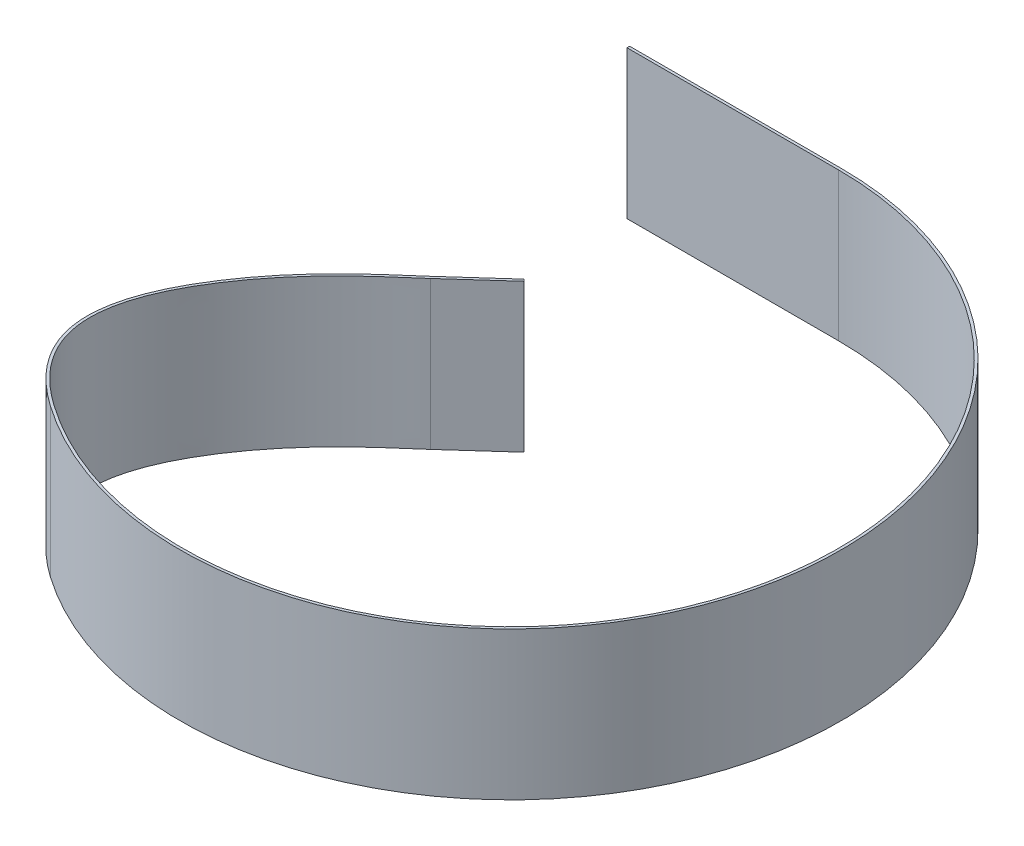
ISO-10303-21;
HEADER;
FILE_DESCRIPTION(('STEP AP214'),'2;1');
FILE_NAME('part.step','',(''),(''),'','','');
FILE_SCHEMA(('AUTOMOTIVE_DESIGN { 1 0 10303 214 1 1 1 1 }'));
ENDSEC;
DATA;
#1=APPLICATION_CONTEXT('core data for automotive mechanical design processes');
#2=APPLICATION_PROTOCOL_DEFINITION('international standard','automotive_design',2000,#1);
#3=PRODUCT_CONTEXT('',#1,'mechanical');
#4=PRODUCT('Part','Part','',(#3));
#5=PRODUCT_RELATED_PRODUCT_CATEGORY('part','',(#4));
#6=PRODUCT_DEFINITION_FORMATION('','',#4);
#7=PRODUCT_DEFINITION_CONTEXT('part definition',#1,'design');
#8=PRODUCT_DEFINITION('design','',#6,#7);
#9=PRODUCT_DEFINITION_SHAPE('','',#8);
#10=(LENGTH_UNIT() NAMED_UNIT(*) SI_UNIT(.MILLI.,.METRE.));
#11=(NAMED_UNIT(*) PLANE_ANGLE_UNIT() SI_UNIT($,.RADIAN.));
#12=(NAMED_UNIT(*) SI_UNIT($,.STERADIAN.) SOLID_ANGLE_UNIT());
#13=UNCERTAINTY_MEASURE_WITH_UNIT(LENGTH_MEASURE(1.E-05),#10,'distance_accuracy_value','');
#14=(GEOMETRIC_REPRESENTATION_CONTEXT(3) GLOBAL_UNCERTAINTY_ASSIGNED_CONTEXT((#13)) GLOBAL_UNIT_ASSIGNED_CONTEXT((#10,
#11,#12)) REPRESENTATION_CONTEXT('',''));
#15=CARTESIAN_POINT('',(0.,0.,0.));
#16=DIRECTION('',(0.,0.,1.));
#17=DIRECTION('',(1.,0.,0.));
#18=AXIS2_PLACEMENT_3D('',#15,#16,#17);
#19=CARTESIAN_POINT('',(0.,88.9,-198.4375));
#20=DIRECTION('',(0.,0.,1.));
#21=DIRECTION('',(1.,0.,0.));
#22=AXIS2_PLACEMENT_3D('',#19,#20,#21);
#23=PLANE('',#22);
#24=DIRECTION('',(1.,0.,0.));
#25=VECTOR('',#24,1.);
#26=CARTESIAN_POINT('',(0.,0.,-198.4375));
#27=LINE('',#26,#25);
#28=CARTESIAN_POINT('',(0.,0.,-198.4375));
#29=VERTEX_POINT('',#28);
#30=CARTESIAN_POINT('',(-127.,0.,-198.4375));
#31=VERTEX_POINT('',#30);
#32=EDGE_CURVE('E221',#29,#31,#27,.F.);
#33=ORIENTED_EDGE('',*,*,#32,.T.);
#34=DIRECTION('',(0.,-1.,0.));
#35=VECTOR('',#34,1.);
#36=CARTESIAN_POINT('',(-127.,88.9,-198.4375));
#37=LINE('',#36,#35);
#38=CARTESIAN_POINT('',(-127.,88.9,-198.4375));
#39=VERTEX_POINT('',#38);
#40=EDGE_CURVE('E11',#39,#31,#37,.T.);
#41=ORIENTED_EDGE('',*,*,#40,.F.);
#42=DIRECTION('',(1.,0.,0.));
#43=VECTOR('',#42,1.);
#44=CARTESIAN_POINT('',(0.,88.9,-198.4375));
#45=LINE('',#44,#43);
#46=CARTESIAN_POINT('',(0.,88.9,-198.4375));
#47=VERTEX_POINT('',#46);
#48=EDGE_CURVE('E101',#47,#39,#45,.F.);
#49=ORIENTED_EDGE('',*,*,#48,.F.);
#50=DIRECTION('',(0.,-1.,0.));
#51=VECTOR('',#50,1.);
#52=CARTESIAN_POINT('',(0.,88.9,-198.4375));
#53=LINE('',#52,#51);
#54=EDGE_CURVE('E142',#47,#29,#53,.T.);
#55=ORIENTED_EDGE('',*,*,#54,.T.);
#56=EDGE_LOOP('',(#33,#41,#49,#55));
#57=FACE_BOUND('',#56,.T.);
#58=ADVANCED_FACE('F39',(#57),#23,.F.);
#59=CARTESIAN_POINT('',(-127.,88.9,-196.85));
#60=DIRECTION('',(-1.,0.,0.));
#61=DIRECTION('',(0.,0.,1.));
#62=AXIS2_PLACEMENT_3D('',#59,#60,#61);
#63=PLANE('',#62);
#64=DIRECTION('',(0.,0.,-1.));
#65=VECTOR('',#64,1.);
#66=CARTESIAN_POINT('',(-127.,0.,-196.85));
#67=LINE('',#66,#65);
#68=CARTESIAN_POINT('',(-127.,0.,-196.85));
#69=VERTEX_POINT('',#68);
#70=EDGE_CURVE('E216',#69,#31,#67,.T.);
#71=ORIENTED_EDGE('',*,*,#70,.F.);
#72=DIRECTION('',(0.,-1.,0.));
#73=VECTOR('',#72,1.);
#74=CARTESIAN_POINT('',(-127.,88.9,-196.85));
#75=LINE('',#74,#73);
#76=CARTESIAN_POINT('',(-127.,88.9,-196.85));
#77=VERTEX_POINT('',#76);
#78=EDGE_CURVE('E47',#77,#69,#75,.T.);
#79=ORIENTED_EDGE('',*,*,#78,.F.);
#80=DIRECTION('',(0.,0.,-1.));
#81=VECTOR('',#80,1.);
#82=CARTESIAN_POINT('',(-127.,88.9,-196.85));
#83=LINE('',#82,#81);
#84=EDGE_CURVE('E250',#77,#39,#83,.T.);
#85=ORIENTED_EDGE('',*,*,#84,.T.);
#86=ORIENTED_EDGE('',*,*,#40,.T.);
#87=EDGE_LOOP('',(#71,#79,#85,#86));
#88=FACE_BOUND('',#87,.T.);
#89=ADVANCED_FACE('F217',(#88),#63,.T.);
#90=CARTESIAN_POINT('',(0.,88.9,-196.85));
#91=DIRECTION('',(0.,0.,1.));
#92=DIRECTION('',(1.,0.,0.));
#93=AXIS2_PLACEMENT_3D('',#90,#91,#92);
#94=PLANE('',#93);
#95=DIRECTION('',(-1.,0.,0.));
#96=VECTOR('',#95,1.);
#97=CARTESIAN_POINT('',(0.,0.,-196.85));
#98=LINE('',#97,#96);
#99=CARTESIAN_POINT('',(0.,0.,-196.85));
#100=VERTEX_POINT('',#99);
#101=EDGE_CURVE('E209',#100,#69,#98,.T.);
#102=ORIENTED_EDGE('',*,*,#101,.F.);
#103=DIRECTION('',(0.,-1.,0.));
#104=VECTOR('',#103,1.);
#105=CARTESIAN_POINT('',(0.,88.9,-196.85));
#106=LINE('',#105,#104);
#107=CARTESIAN_POINT('',(0.,88.9,-196.85));
#108=VERTEX_POINT('',#107);
#109=EDGE_CURVE('E202',#108,#100,#106,.T.);
#110=ORIENTED_EDGE('',*,*,#109,.F.);
#111=DIRECTION('',(-1.,0.,0.));
#112=VECTOR('',#111,1.);
#113=CARTESIAN_POINT('',(0.,88.9,-196.85));
#114=LINE('',#113,#112);
#115=EDGE_CURVE('E212',#108,#77,#114,.T.);
#116=ORIENTED_EDGE('',*,*,#115,.T.);
#117=ORIENTED_EDGE('',*,*,#78,.T.);
#118=EDGE_LOOP('',(#102,#110,#116,#117));
#119=FACE_BOUND('',#118,.T.);
#120=ADVANCED_FACE('F207',(#119),#94,.T.);
#121=CARTESIAN_POINT('',(0.,88.9,0.));
#122=DIRECTION('',(0.,-1.,0.));
#123=DIRECTION('',(0.,0.,-1.));
#124=AXIS2_PLACEMENT_3D('',#121,#122,#123);
#125=CYLINDRICAL_SURFACE('',#124,196.85);
#126=CARTESIAN_POINT('',(0.,0.,0.));
#127=DIRECTION('',(0.,1.,0.));
#128=DIRECTION('',(0.,0.,1.));
#129=AXIS2_PLACEMENT_3D('',#126,#127,#128);
#130=CIRCLE('',#129,196.85);
#131=CARTESIAN_POINT('',(-112.908521495704,0.,161.250079918288));
#132=VERTEX_POINT('',#131);
#133=EDGE_CURVE('E226',#132,#100,#130,.T.);
#134=ORIENTED_EDGE('',*,*,#133,.F.);
#135=DIRECTION('',(0.,-1.,0.));
#136=VECTOR('',#135,1.);
#137=CARTESIAN_POINT('',(-112.908521495704,88.9,161.250079918288));
#138=LINE('',#137,#136);
#139=CARTESIAN_POINT('',(-112.908521495704,88.9,161.250079918288));
#140=VERTEX_POINT('',#139);
#141=EDGE_CURVE('E200',#140,#132,#138,.T.);
#142=ORIENTED_EDGE('',*,*,#141,.F.);
#143=CARTESIAN_POINT('',(0.,88.9,0.));
#144=DIRECTION('',(0.,1.,0.));
#145=DIRECTION('',(0.,0.,1.));
#146=AXIS2_PLACEMENT_3D('',#143,#144,#145);
#147=CIRCLE('',#146,196.85);
#148=EDGE_CURVE('E183',#140,#108,#147,.T.);
#149=ORIENTED_EDGE('',*,*,#148,.T.);
#150=ORIENTED_EDGE('',*,*,#109,.T.);
#151=EDGE_LOOP('',(#134,#142,#149,#150));
#152=FACE_BOUND('',#151,.T.);
#153=ADVANCED_FACE('F172',(#152),#125,.F.);
#154=CARTESIAN_POINT('',(-66.0024496483373,88.9,-17.8844728997143));
#155=CARTESIAN_POINT('',(-66.4535877933624,88.9,-17.4782662893966));
#156=CARTESIAN_POINT('',(-67.3455990510589,88.9,-16.6824248164121));
#157=CARTESIAN_POINT('',(-69.251908014198,88.9,-15.0029626165492));
#158=CARTESIAN_POINT('',(-71.788924143044,88.9,-12.794824311987));
#159=CARTESIAN_POINT('',(-75.0919496078127,88.9,-9.92560648370046));
#160=CARTESIAN_POINT('',(-79.8061970469973,88.9,-5.79511599937475));
#161=CARTESIAN_POINT('',(-86.2257511246115,88.9,-0.0297921201301938));
#162=CARTESIAN_POINT('',(-94.5507374651459,88.9,7.90614390022119));
#163=CARTESIAN_POINT('',(-103.257345936926,88.9,16.8945797608324));
#164=CARTESIAN_POINT('',(-112.101117892182,88.9,26.9654788928242));
#165=CARTESIAN_POINT('',(-120.828764325615,88.9,38.1334318247923));
#166=CARTESIAN_POINT('',(-129.216728981837,88.9,50.4549237361451));
#167=CARTESIAN_POINT('',(-136.940899544424,88.9,63.8288896466943));
#168=CARTESIAN_POINT('',(-143.161892373003,88.9,77.7582718705679));
#169=CARTESIAN_POINT('',(-147.210909845573,88.9,91.8686804501743));
#170=CARTESIAN_POINT('',(-148.31437068579,88.9,103.458143904325));
#171=CARTESIAN_POINT('',(-147.621588874118,88.9,112.577839852921));
#172=CARTESIAN_POINT('',(-146.250002481882,88.9,119.374309222635));
#173=CARTESIAN_POINT('',(-143.936843504465,88.9,126.17470344159));
#174=CARTESIAN_POINT('',(-140.558076203167,88.9,133.031995567463));
#175=CARTESIAN_POINT('',(-135.959944926544,88.9,139.980748795807));
#176=CARTESIAN_POINT('',(-130.973108438022,88.9,145.8499680956));
#177=CARTESIAN_POINT('',(-126.208771051371,88.9,150.578610224839));
#178=CARTESIAN_POINT('',(-122.231373292768,88.9,154.134237209882));
#179=CARTESIAN_POINT('',(-118.558206922946,88.9,157.104221465783));
#180=CARTESIAN_POINT('',(-115.41175898818,88.9,159.469720498676));
#181=CARTESIAN_POINT('',(-113.741298162684,88.9,160.666963418423));
#182=CARTESIAN_POINT('',(-112.908521495704,88.9,161.250079918288));
#183=B_SPLINE_CURVE_WITH_KNOTS('',3,(#154,#155,#156,#157,#158,#159,#160,#161,#162,#163,#164,
#165,#166,#167,#168,#169,#170,#171,#172,#173,#174,#175,#176,#177,#178,#179,#180,#181,#182),
.UNSPECIFIED.,.F.,.F.,(4,1,1,1,1,1,1,1,1,1,1,1,1,1,1,1,1,1,1,1,1,1,1,1,1,1,4),(0.,
0.0138611581351266,0.0277223162702532,0.0554446325405066,0.0831669488107599,0.110889265081013,
0.16633389762152,0.221778530162027,0.277223162702533,0.33266779524304,0.388112427783546,
0.443557060324053,0.49900169286456,0.554446325405066,0.609890957945573,0.665335590486079,
0.693057906756333,0.720780223026586,0.748502539296839,0.776224855567093,0.803947171837346,
0.831669488107599,0.845530646242726,0.859391804377853,0.873252962512979,0.880183541580543,
0.887114120648106),.UNSPECIFIED.);
#184=DIRECTION('',(0.,-1.,0.));
#185=VECTOR('',#184,1.);
#186=SURFACE_OF_LINEAR_EXTRUSION('',#183,#185);
#187=CARTESIAN_POINT('',(-66.0024496483373,0.,-17.8844728997143));
#188=CARTESIAN_POINT('',(-66.4535877933624,0.,-17.4782662893966));
#189=CARTESIAN_POINT('',(-67.3455990510589,0.,-16.6824248164121));
#190=CARTESIAN_POINT('',(-69.251908014198,0.,-15.0029626165492));
#191=CARTESIAN_POINT('',(-71.788924143044,0.,-12.794824311987));
#192=CARTESIAN_POINT('',(-75.0919496078127,0.,-9.92560648370046));
#193=CARTESIAN_POINT('',(-79.8061970469973,0.,-5.79511599937475));
#194=CARTESIAN_POINT('',(-86.2257511246115,0.,-0.0297921201301938));
#195=CARTESIAN_POINT('',(-94.5507374651459,0.,7.90614390022119));
#196=CARTESIAN_POINT('',(-103.257345936926,0.,16.8945797608324));
#197=CARTESIAN_POINT('',(-112.101117892182,0.,26.9654788928242));
#198=CARTESIAN_POINT('',(-120.828764325615,0.,38.1334318247923));
#199=CARTESIAN_POINT('',(-129.216728981837,0.,50.4549237361451));
#200=CARTESIAN_POINT('',(-136.940899544424,0.,63.8288896466943));
#201=CARTESIAN_POINT('',(-143.161892373003,0.,77.7582718705679));
#202=CARTESIAN_POINT('',(-147.210909845573,0.,91.8686804501743));
#203=CARTESIAN_POINT('',(-148.31437068579,0.,103.458143904325));
#204=CARTESIAN_POINT('',(-147.621588874118,0.,112.577839852921));
#205=CARTESIAN_POINT('',(-146.250002481882,0.,119.374309222635));
#206=CARTESIAN_POINT('',(-143.936843504465,0.,126.17470344159));
#207=CARTESIAN_POINT('',(-140.558076203167,0.,133.031995567463));
#208=CARTESIAN_POINT('',(-135.959944926544,0.,139.980748795807));
#209=CARTESIAN_POINT('',(-130.973108438022,0.,145.8499680956));
#210=CARTESIAN_POINT('',(-126.208771051371,0.,150.578610224839));
#211=CARTESIAN_POINT('',(-122.231373292768,0.,154.134237209882));
#212=CARTESIAN_POINT('',(-118.558206922946,0.,157.104221465783));
#213=CARTESIAN_POINT('',(-115.41175898818,0.,159.469720498676));
#214=CARTESIAN_POINT('',(-113.741298162684,0.,160.666963418423));
#215=CARTESIAN_POINT('',(-112.908521495704,0.,161.250079918288));
#216=B_SPLINE_CURVE_WITH_KNOTS('',3,(#187,#188,#189,#190,#191,#192,#193,#194,#195,#196,#197,
#198,#199,#200,#201,#202,#203,#204,#205,#206,#207,#208,#209,#210,#211,#212,#213,#214,#215),
.UNSPECIFIED.,.F.,.F.,(4,1,1,1,1,1,1,1,1,1,1,1,1,1,1,1,1,1,1,1,1,1,1,1,1,1,4),(0.,
0.0138611581351266,0.0277223162702532,0.0554446325405066,0.0831669488107599,0.110889265081013,
0.16633389762152,0.221778530162027,0.277223162702533,0.33266779524304,0.388112427783546,
0.443557060324053,0.49900169286456,0.554446325405066,0.609890957945573,0.665335590486079,
0.693057906756333,0.720780223026586,0.748502539296839,0.776224855567093,0.803947171837346,
0.831669488107599,0.845530646242726,0.859391804377853,0.873252962512979,0.880183541580543,
0.887114120648106),.UNSPECIFIED.);
#217=CARTESIAN_POINT('',(-66.0024496483373,0.,-17.8844728997143));
#218=VERTEX_POINT('',#217);
#219=EDGE_CURVE('E228',#218,#132,#216,.T.);
#220=ORIENTED_EDGE('',*,*,#219,.F.);
#221=DIRECTION('',(0.,-1.,0.));
#222=VECTOR('',#221,1.);
#223=CARTESIAN_POINT('',(-66.0024496483373,88.9,-17.8844728997143));
#224=LINE('',#223,#222);
#225=CARTESIAN_POINT('',(-66.0024496483373,88.9,-17.8844728997143));
#226=VERTEX_POINT('',#225);
#227=EDGE_CURVE('E195',#226,#218,#224,.T.);
#228=ORIENTED_EDGE('',*,*,#227,.F.);
#229=EDGE_CURVE('E175',#226,#140,#183,.T.);
#230=ORIENTED_EDGE('',*,*,#229,.T.);
#231=ORIENTED_EDGE('',*,*,#141,.T.);
#232=EDGE_LOOP('',(#220,#228,#230,#231));
#233=FACE_BOUND('',#232,.T.);
#234=ADVANCED_FACE('F167',(#233),#186,.T.);
#235=CARTESIAN_POINT('',(-36.498442787726,88.9,-44.45));
#236=DIRECTION('',(0.66913060635886,0.,0.743144825477393));
#237=DIRECTION('',(0.743144825477393,0.,-0.66913060635886));
#238=AXIS2_PLACEMENT_3D('',#235,#236,#237);
#239=PLANE('',#238);
#240=DIRECTION('',(-0.743144825477393,0.,0.66913060635886));
#241=VECTOR('',#240,1.);
#242=CARTESIAN_POINT('',(-36.498442787726,0.,-44.45));
#243=LINE('',#242,#241);
#244=CARTESIAN_POINT('',(-36.498442787726,0.,-44.45));
#245=VERTEX_POINT('',#244);
#246=EDGE_CURVE('E234',#245,#218,#243,.T.);
#247=ORIENTED_EDGE('',*,*,#246,.F.);
#248=DIRECTION('',(0.,-1.,0.));
#249=VECTOR('',#248,1.);
#250=CARTESIAN_POINT('',(-36.498442787726,88.9,-44.45));
#251=LINE('',#250,#249);
#252=CARTESIAN_POINT('',(-36.498442787726,88.9,-44.45));
#253=VERTEX_POINT('',#252);
#254=EDGE_CURVE('E190',#253,#245,#251,.T.);
#255=ORIENTED_EDGE('',*,*,#254,.F.);
#256=DIRECTION('',(-0.743144825477393,0.,0.66913060635886));
#257=VECTOR('',#256,1.);
#258=CARTESIAN_POINT('',(-36.498442787726,88.9,-44.45));
#259=LINE('',#258,#257);
#260=EDGE_CURVE('E182',#253,#226,#259,.T.);
#261=ORIENTED_EDGE('',*,*,#260,.T.);
#262=ORIENTED_EDGE('',*,*,#227,.T.);
#263=EDGE_LOOP('',(#247,#255,#261,#262));
#264=FACE_BOUND('',#263,.T.);
#265=ADVANCED_FACE('F163',(#264),#239,.T.);
#266=CARTESIAN_POINT('',(-37.5606876253207,88.9,-45.6297424104454));
#267=DIRECTION('',(0.743144825477393,0.,-0.66913060635886));
#268=DIRECTION('',(-0.66913060635886,0.,-0.743144825477393));
#269=AXIS2_PLACEMENT_3D('',#266,#267,#268);
#270=PLANE('',#269);
#271=DIRECTION('',(0.66913060635886,0.,0.743144825477393));
#272=VECTOR('',#271,1.);
#273=CARTESIAN_POINT('',(-37.5606876253207,0.,-45.6297424104454));
#274=LINE('',#273,#272);
#275=CARTESIAN_POINT('',(-37.5606876253207,0.,-45.6297424104454));
#276=VERTEX_POINT('',#275);
#277=EDGE_CURVE('E193',#276,#245,#274,.T.);
#278=ORIENTED_EDGE('',*,*,#277,.F.);
#279=DIRECTION('',(0.,-1.,0.));
#280=VECTOR('',#279,1.);
#281=CARTESIAN_POINT('',(-37.5606876253207,88.9,-45.6297424104454));
#282=LINE('',#281,#280);
#283=CARTESIAN_POINT('',(-37.5606876253207,88.9,-45.6297424104454));
#284=VERTEX_POINT('',#283);
#285=EDGE_CURVE('E137',#284,#276,#282,.T.);
#286=ORIENTED_EDGE('',*,*,#285,.F.);
#287=DIRECTION('',(0.66913060635886,0.,0.743144825477393));
#288=VECTOR('',#287,1.);
#289=CARTESIAN_POINT('',(-37.5606876253207,88.9,-45.6297424104454));
#290=LINE('',#289,#288);
#291=EDGE_CURVE('E130',#284,#253,#290,.T.);
#292=ORIENTED_EDGE('',*,*,#291,.T.);
#293=ORIENTED_EDGE('',*,*,#254,.T.);
#294=EDGE_LOOP('',(#278,#286,#292,#293));
#295=FACE_BOUND('',#294,.T.);
#296=ADVANCED_FACE('F160',(#295),#270,.T.);
#297=CARTESIAN_POINT('',(-37.5606876253207,88.9,-45.6297424104454));
#298=DIRECTION('',(0.66913060635886,0.,0.743144825477393));
#299=DIRECTION('',(0.743144825477393,0.,-0.66913060635886));
#300=AXIS2_PLACEMENT_3D('',#297,#298,#299);
#301=PLANE('',#300);
#302=DIRECTION('',(-0.743144825477393,0.,0.66913060635886));
#303=VECTOR('',#302,1.);
#304=CARTESIAN_POINT('',(-37.5606876253207,0.,-45.6297424104454));
#305=LINE('',#304,#303);
#306=CARTESIAN_POINT('',(-67.064694485932,0.,-19.0642153101597));
#307=VERTEX_POINT('',#306);
#308=EDGE_CURVE('E136',#276,#307,#305,.T.);
#309=ORIENTED_EDGE('',*,*,#308,.T.);
#310=DIRECTION('',(0.,-1.,0.));
#311=VECTOR('',#310,1.);
#312=CARTESIAN_POINT('',(-67.064694485932,88.9,-19.0642153101597));
#313=LINE('',#312,#311);
#314=CARTESIAN_POINT('',(-67.064694485932,88.9,-19.0642153101597));
#315=VERTEX_POINT('',#314);
#316=EDGE_CURVE('E133',#315,#307,#313,.T.);
#317=ORIENTED_EDGE('',*,*,#316,.F.);
#318=DIRECTION('',(-0.743144825477393,0.,0.66913060635886));
#319=VECTOR('',#318,1.);
#320=CARTESIAN_POINT('',(-37.5606876253207,88.9,-45.6297424104454));
#321=LINE('',#320,#319);
#322=EDGE_CURVE('E123',#284,#315,#321,.T.);
#323=ORIENTED_EDGE('',*,*,#322,.F.);
#324=ORIENTED_EDGE('',*,*,#285,.T.);
#325=EDGE_LOOP('',(#309,#317,#323,#324));
#326=FACE_BOUND('',#325,.T.);
#327=ADVANCED_FACE('F134',(#326),#301,.F.);
#328=CARTESIAN_POINT('',(-67.0646944859319,88.9,-19.0642153101597));
#329=CARTESIAN_POINT('',(-67.5123044387745,88.9,-18.6611854983523));
#330=CARTESIAN_POINT('',(-67.9551023909119,88.9,-18.2661229476099));
#331=CARTESIAN_POINT('',(-68.872729801477,88.9,-17.4527292275026));
#332=CARTESIAN_POINT('',(-69.3473142608288,88.9,-17.0346170891996));
#333=CARTESIAN_POINT('',(-70.802994816759,88.9,-15.757537091635));
#334=CARTESIAN_POINT('',(-71.8161310917068,88.9,-14.8757292431817));
#335=CARTESIAN_POINT('',(-74.9886924382968,88.9,-12.1172468688137));
#336=CARTESIAN_POINT('',(-77.2800721107781,88.9,-10.128491367995));
#337=CARTESIAN_POINT('',(-84.5821858480731,88.9,-3.67415385299682));
#338=CARTESIAN_POINT('',(-90.0262606126615,88.9,1.28435614913448));
#339=CARTESIAN_POINT('',(-101.440385317245,88.9,12.6266228789879));
#340=CARTESIAN_POINT('',(-107.409172858783,88.9,19.0100871552374));
#341=CARTESIAN_POINT('',(-116.252796510844,88.9,29.6995153106998));
#342=CARTESIAN_POINT('',(-119.182120842643,88.9,33.4478298378293));
#343=CARTESIAN_POINT('',(-124.928234054716,88.9,41.3337889573397));
#344=CARTESIAN_POINT('',(-127.744912223715,88.9,45.47125665122));
#345=CARTESIAN_POINT('',(-133.157203889158,88.9,54.1027204715375));
#346=CARTESIAN_POINT('',(-135.75496211648,88.9,58.5998971226881));
#347=CARTESIAN_POINT('',(-140.453322416897,88.9,67.7988547357973));
#348=CARTESIAN_POINT('',(-142.553268995806,88.9,72.4992223873085));
#349=CARTESIAN_POINT('',(-146.027842566337,88.9,81.985709079352));
#350=CARTESIAN_POINT('',(-147.401894666237,88.9,86.7701065059958));
#351=CARTESIAN_POINT('',(-149.229813654371,88.9,96.3015748128057));
#352=CARTESIAN_POINT('',(-149.683131709763,88.9,101.0478857231));
#353=CARTESIAN_POINT('',(-149.511096887446,88.9,110.460954732744));
#354=CARTESIAN_POINT('',(-148.889230889081,88.9,115.126263437114));
#355=CARTESIAN_POINT('',(-146.993343946223,88.9,122.122165068173));
#356=CARTESIAN_POINT('',(-146.199696578408,88.9,124.455098814042));
#357=CARTESIAN_POINT('',(-144.249463658549,88.9,129.134651607689));
#358=CARTESIAN_POINT('',(-143.092429230443,88.9,131.482378871933));
#359=CARTESIAN_POINT('',(-140.366383882415,88.9,136.20049147483));
#360=CARTESIAN_POINT('',(-138.796962052794,88.9,138.571659295687));
#361=CARTESIAN_POINT('',(-135.193197127037,88.9,143.336507209459));
#362=CARTESIAN_POINT('',(-133.158587596331,88.9,145.730602241969));
#363=CARTESIAN_POINT('',(-128.572257647049,88.9,150.532205717169));
#364=CARTESIAN_POINT('',(-126.022120384449,88.9,152.938660304707));
#365=CARTESIAN_POINT('',(-121.769630358283,88.9,156.549316196165));
#366=CARTESIAN_POINT('',(-120.280715667145,88.9,157.753149063812));
#367=CARTESIAN_POINT('',(-117.943674717478,88.9,159.552363046343));
#368=CARTESIAN_POINT('',(-117.147213580727,88.9,160.151137690389));
#369=CARTESIAN_POINT('',(-115.505927687951,88.9,161.355400206591));
#370=CARTESIAN_POINT('',(-114.661481322571,88.9,161.960623892995));
#371=CARTESIAN_POINT('',(-113.819074088411,88.9,162.550483788597));
#372=B_SPLINE_CURVE_WITH_KNOTS('',3,(#328,#329,#330,#331,#332,#333,#334,#335,#336,#337,#338,
#339,#340,#341,#342,#343,#344,#345,#346,#347,#348,#349,#350,#351,#352,#353,#354,#355,#356,#357,
#358,#359,#360,#361,#362,#363,#364,#365,#366,#367,#368,#369,#370,#371),.UNSPECIFIED.,.F.,.F.,(4,
2,2,2,2,2,2,2,2,2,2,2,2,2,2,2,2,2,2,2,2,4),(0.,0.0156250000000001,0.0312500000000002,
0.0625000000000003,0.125,0.25,0.375,0.4375,0.5,0.5625,0.625,0.6875,0.75,0.8125,0.84375,0.875,
0.90625,0.9375,0.96875,0.984375,0.9921875,1.),.UNSPECIFIED.);
#373=DIRECTION('',(0.,-1.,0.));
#374=VECTOR('',#373,1.);
#375=SURFACE_OF_LINEAR_EXTRUSION('',#372,#374);
#376=CARTESIAN_POINT('',(-67.0646944859319,0.,-19.0642153101597));
#377=CARTESIAN_POINT('',(-67.5123044387745,0.,-18.6611854983523));
#378=CARTESIAN_POINT('',(-67.9551023909119,0.,-18.2661229476099));
#379=CARTESIAN_POINT('',(-68.872729801477,0.,-17.4527292275026));
#380=CARTESIAN_POINT('',(-69.3473142608288,0.,-17.0346170891996));
#381=CARTESIAN_POINT('',(-70.802994816759,0.,-15.757537091635));
#382=CARTESIAN_POINT('',(-71.8161310917068,0.,-14.8757292431817));
#383=CARTESIAN_POINT('',(-74.9886924382968,0.,-12.1172468688137));
#384=CARTESIAN_POINT('',(-77.2800721107781,0.,-10.128491367995));
#385=CARTESIAN_POINT('',(-84.5821858480731,0.,-3.67415385299682));
#386=CARTESIAN_POINT('',(-90.0262606126615,0.,1.28435614913448));
#387=CARTESIAN_POINT('',(-101.440385317245,0.,12.6266228789879));
#388=CARTESIAN_POINT('',(-107.409172858783,0.,19.0100871552374));
#389=CARTESIAN_POINT('',(-116.252796510844,0.,29.6995153106998));
#390=CARTESIAN_POINT('',(-119.182120842643,0.,33.4478298378293));
#391=CARTESIAN_POINT('',(-124.928234054716,0.,41.3337889573397));
#392=CARTESIAN_POINT('',(-127.744912223715,0.,45.47125665122));
#393=CARTESIAN_POINT('',(-133.157203889158,0.,54.1027204715375));
#394=CARTESIAN_POINT('',(-135.75496211648,0.,58.5998971226881));
#395=CARTESIAN_POINT('',(-140.453322416897,0.,67.7988547357973));
#396=CARTESIAN_POINT('',(-142.553268995806,0.,72.4992223873085));
#397=CARTESIAN_POINT('',(-146.027842566337,0.,81.985709079352));
#398=CARTESIAN_POINT('',(-147.401894666237,0.,86.7701065059958));
#399=CARTESIAN_POINT('',(-149.229813654371,0.,96.3015748128057));
#400=CARTESIAN_POINT('',(-149.683131709763,0.,101.0478857231));
#401=CARTESIAN_POINT('',(-149.511096887446,0.,110.460954732744));
#402=CARTESIAN_POINT('',(-148.889230889081,0.,115.126263437114));
#403=CARTESIAN_POINT('',(-146.993343946223,0.,122.122165068173));
#404=CARTESIAN_POINT('',(-146.199696578408,0.,124.455098814042));
#405=CARTESIAN_POINT('',(-144.249463658549,0.,129.134651607689));
#406=CARTESIAN_POINT('',(-143.092429230443,0.,131.482378871933));
#407=CARTESIAN_POINT('',(-140.366383882415,0.,136.20049147483));
#408=CARTESIAN_POINT('',(-138.796962052794,0.,138.571659295687));
#409=CARTESIAN_POINT('',(-135.193197127037,0.,143.336507209459));
#410=CARTESIAN_POINT('',(-133.158587596331,0.,145.730602241969));
#411=CARTESIAN_POINT('',(-128.572257647049,0.,150.532205717169));
#412=CARTESIAN_POINT('',(-126.022120384449,0.,152.938660304707));
#413=CARTESIAN_POINT('',(-121.769630358283,0.,156.549316196165));
#414=CARTESIAN_POINT('',(-120.280715667145,0.,157.753149063812));
#415=CARTESIAN_POINT('',(-117.943674717478,0.,159.552363046343));
#416=CARTESIAN_POINT('',(-117.147213580727,0.,160.151137690389));
#417=CARTESIAN_POINT('',(-115.505927687951,0.,161.355400206591));
#418=CARTESIAN_POINT('',(-114.661481322571,0.,161.960623892995));
#419=CARTESIAN_POINT('',(-113.819074088411,0.,162.550483788597));
#420=B_SPLINE_CURVE_WITH_KNOTS('',3,(#376,#377,#378,#379,#380,#381,#382,#383,#384,#385,#386,
#387,#388,#389,#390,#391,#392,#393,#394,#395,#396,#397,#398,#399,#400,#401,#402,#403,#404,#405,
#406,#407,#408,#409,#410,#411,#412,#413,#414,#415,#416,#417,#418,#419),.UNSPECIFIED.,.F.,.F.,(4,
2,2,2,2,2,2,2,2,2,2,2,2,2,2,2,2,2,2,2,2,4),(0.,0.0156250000000001,0.0312500000000002,
0.0625000000000003,0.125,0.25,0.375,0.4375,0.5,0.5625,0.625,0.6875,0.75,0.8125,0.84375,0.875,
0.90625,0.9375,0.96875,0.984375,0.9921875,1.),.UNSPECIFIED.);
#421=CARTESIAN_POINT('',(-113.819074088411,0.,162.550483788597));
#422=VERTEX_POINT('',#421);
#423=EDGE_CURVE('E89',#307,#422,#420,.T.);
#424=ORIENTED_EDGE('',*,*,#423,.T.);
#425=DIRECTION('',(0.,-1.,0.));
#426=VECTOR('',#425,1.);
#427=CARTESIAN_POINT('',(-113.819074088411,88.9,162.550483788597));
#428=LINE('',#427,#426);
#429=CARTESIAN_POINT('',(-113.819074088411,88.9,162.550483788597));
#430=VERTEX_POINT('',#429);
#431=EDGE_CURVE('E138',#430,#422,#428,.T.);
#432=ORIENTED_EDGE('',*,*,#431,.F.);
#433=EDGE_CURVE('E127',#315,#430,#372,.T.);
#434=ORIENTED_EDGE('',*,*,#433,.F.);
#435=ORIENTED_EDGE('',*,*,#316,.T.);
#436=EDGE_LOOP('',(#424,#432,#434,#435));
#437=FACE_BOUND('',#436,.T.);
#438=ADVANCED_FACE('F140',(#437),#375,.F.);
#439=CARTESIAN_POINT('',(0.,88.9,0.));
#440=DIRECTION('',(0.,-1.,0.));
#441=DIRECTION('',(0.,0.,-1.));
#442=AXIS2_PLACEMENT_3D('',#439,#440,#441);
#443=CYLINDRICAL_SURFACE('',#442,198.4375);
#444=CARTESIAN_POINT('',(0.,0.,0.));
#445=DIRECTION('',(0.,1.,0.));
#446=DIRECTION('',(1.,0.,0.));
#447=AXIS2_PLACEMENT_3D('',#444,#445,#446);
#448=CIRCLE('',#447,198.4375);
#449=EDGE_CURVE('E95',#422,#29,#448,.T.);
#450=ORIENTED_EDGE('',*,*,#449,.T.);
#451=ORIENTED_EDGE('',*,*,#54,.F.);
#452=CARTESIAN_POINT('',(0.,88.9,0.));
#453=DIRECTION('',(0.,1.,0.));
#454=DIRECTION('',(1.,0.,0.));
#455=AXIS2_PLACEMENT_3D('',#452,#453,#454);
#456=CIRCLE('',#455,198.4375);
#457=EDGE_CURVE('E55',#430,#47,#456,.T.);
#458=ORIENTED_EDGE('',*,*,#457,.F.);
#459=ORIENTED_EDGE('',*,*,#431,.T.);
#460=EDGE_LOOP('',(#450,#451,#458,#459));
#461=FACE_BOUND('',#460,.T.);
#462=ADVANCED_FACE('F156',(#461),#443,.T.);
#463=CARTESIAN_POINT('',(0.,88.9,0.));
#464=DIRECTION('',(0.,1.,0.));
#465=DIRECTION('',(1.,0.,0.));
#466=AXIS2_PLACEMENT_3D('',#463,#464,#465);
#467=PLANE('',#466);
#468=ORIENTED_EDGE('',*,*,#48,.T.);
#469=ORIENTED_EDGE('',*,*,#84,.F.);
#470=ORIENTED_EDGE('',*,*,#115,.F.);
#471=ORIENTED_EDGE('',*,*,#148,.F.);
#472=ORIENTED_EDGE('',*,*,#229,.F.);
#473=ORIENTED_EDGE('',*,*,#260,.F.);
#474=ORIENTED_EDGE('',*,*,#291,.F.);
#475=ORIENTED_EDGE('',*,*,#322,.T.);
#476=ORIENTED_EDGE('',*,*,#433,.T.);
#477=ORIENTED_EDGE('',*,*,#457,.T.);
#478=EDGE_LOOP('',(#468,#469,#470,#471,#472,#473,#474,#475,#476,#477));
#479=FACE_BOUND('',#478,.T.);
#480=ADVANCED_FACE('F125',(#479),#467,.T.);
#481=CARTESIAN_POINT('',(0.,0.,0.));
#482=DIRECTION('',(0.,1.,0.));
#483=DIRECTION('',(1.,0.,0.));
#484=AXIS2_PLACEMENT_3D('',#481,#482,#483);
#485=PLANE('',#484);
#486=ORIENTED_EDGE('',*,*,#32,.F.);
#487=ORIENTED_EDGE('',*,*,#449,.F.);
#488=ORIENTED_EDGE('',*,*,#423,.F.);
#489=ORIENTED_EDGE('',*,*,#308,.F.);
#490=ORIENTED_EDGE('',*,*,#277,.T.);
#491=ORIENTED_EDGE('',*,*,#246,.T.);
#492=ORIENTED_EDGE('',*,*,#219,.T.);
#493=ORIENTED_EDGE('',*,*,#133,.T.);
#494=ORIENTED_EDGE('',*,*,#101,.T.);
#495=ORIENTED_EDGE('',*,*,#70,.T.);
#496=EDGE_LOOP('',(#486,#487,#488,#489,#490,#491,#492,#493,#494,#495));
#497=FACE_BOUND('',#496,.T.);
#498=ADVANCED_FACE('F223',(#497),#485,.F.);
#499=CLOSED_SHELL('',(#58,#89,#120,#153,#234,#265,#296,#327,#438,#462,#480,#498));
#500=MANIFOLD_SOLID_BREP('B2',#499);
#501=ADVANCED_BREP_SHAPE_REPRESENTATION('',(#18,#500),#14);
#502=SHAPE_DEFINITION_REPRESENTATION(#9,#501);
ENDSEC;
END-ISO-10303-21;
